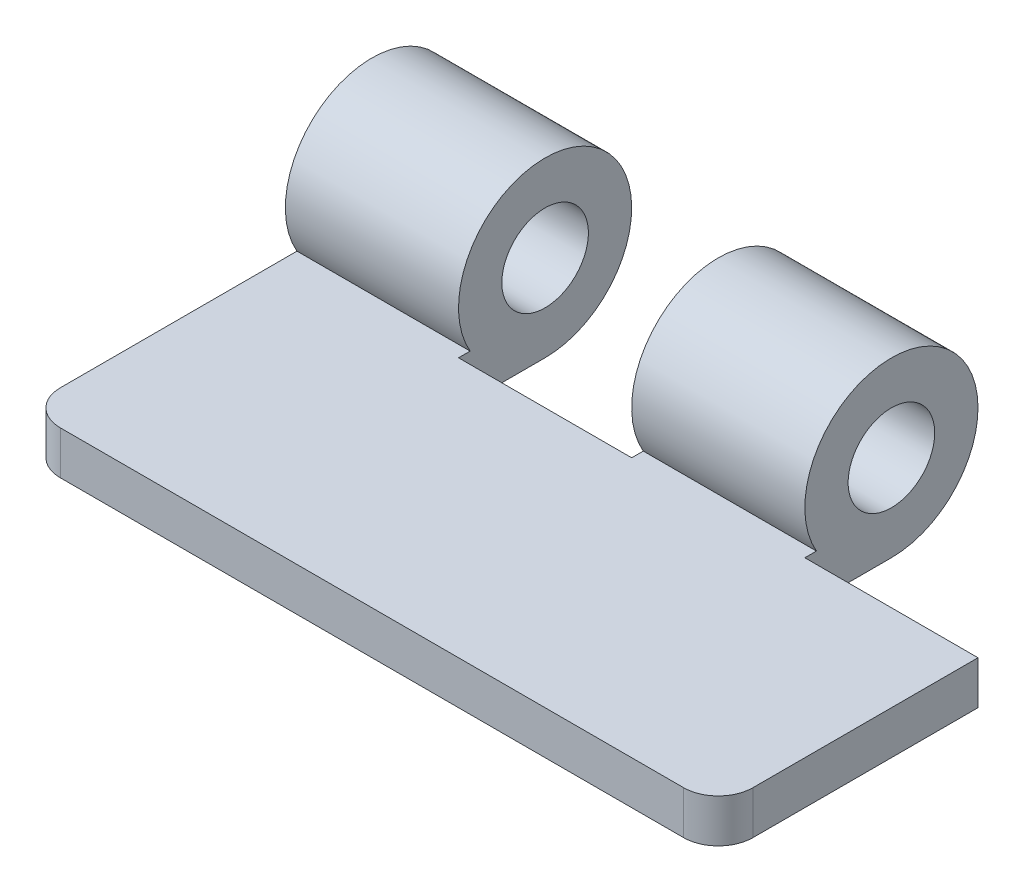
ISO-10303-21;
HEADER;
FILE_DESCRIPTION(('STEP AP214'),'2;1');
FILE_NAME('part.step','',(''),(''),'','','');
FILE_SCHEMA(('AUTOMOTIVE_DESIGN { 1 0 10303 214 1 1 1 1 }'));
ENDSEC;
DATA;
#1=APPLICATION_CONTEXT('core data for automotive mechanical design processes');
#2=APPLICATION_PROTOCOL_DEFINITION('international standard','automotive_design',2000,#1);
#3=PRODUCT_CONTEXT('',#1,'mechanical');
#4=PRODUCT('Part','Part','',(#3));
#5=PRODUCT_RELATED_PRODUCT_CATEGORY('part','',(#4));
#6=PRODUCT_DEFINITION_FORMATION('','',#4);
#7=PRODUCT_DEFINITION_CONTEXT('part definition',#1,'design');
#8=PRODUCT_DEFINITION('design','',#6,#7);
#9=PRODUCT_DEFINITION_SHAPE('','',#8);
#10=(LENGTH_UNIT() NAMED_UNIT(*) SI_UNIT(.MILLI.,.METRE.));
#11=(NAMED_UNIT(*) PLANE_ANGLE_UNIT() SI_UNIT($,.RADIAN.));
#12=(NAMED_UNIT(*) SI_UNIT($,.STERADIAN.) SOLID_ANGLE_UNIT());
#13=UNCERTAINTY_MEASURE_WITH_UNIT(LENGTH_MEASURE(1.E-05),#10,'distance_accuracy_value','');
#14=(GEOMETRIC_REPRESENTATION_CONTEXT(3) GLOBAL_UNCERTAINTY_ASSIGNED_CONTEXT((#13)) GLOBAL_UNIT_ASSIGNED_CONTEXT((#10,
#11,#12)) REPRESENTATION_CONTEXT('',''));
#15=CARTESIAN_POINT('',(0.,0.,0.));
#16=DIRECTION('',(0.,0.,1.));
#17=DIRECTION('',(1.,0.,0.));
#18=AXIS2_PLACEMENT_3D('',#15,#16,#17);
#19=CARTESIAN_POINT('',(0.,3.175,0.));
#20=DIRECTION('',(0.,-1.,0.));
#21=DIRECTION('',(0.,0.,-1.));
#22=AXIS2_PLACEMENT_3D('',#19,#20,#21);
#23=PLANE('',#22);
#24=DIRECTION('',(-1.,0.,0.));
#25=VECTOR('',#24,1.);
#26=CARTESIAN_POINT('',(0.,3.175,-9.95321765143749));
#27=LINE('',#26,#25);
#28=CARTESIAN_POINT('',(0.,3.175,-9.95321765143749));
#29=VERTEX_POINT('',#28);
#30=CARTESIAN_POINT('',(-12.7,3.175,-9.95321765143749));
#31=VERTEX_POINT('',#30);
#32=EDGE_CURVE('E184',#29,#31,#27,.T.);
#33=ORIENTED_EDGE('',*,*,#32,.T.);
#34=DIRECTION('',(0.,0.,-1.));
#35=VECTOR('',#34,1.);
#36=CARTESIAN_POINT('',(-12.7,3.175,-16.3032176514375));
#37=LINE('',#36,#35);
#38=CARTESIAN_POINT('',(-12.7,3.175,-10.8039563374063));
#39=VERTEX_POINT('',#38);
#40=EDGE_CURVE('E57',#31,#39,#37,.T.);
#41=ORIENTED_EDGE('',*,*,#40,.T.);
#42=DIRECTION('',(-1.,0.,0.));
#43=VECTOR('',#42,1.);
#44=CARTESIAN_POINT('',(-12.7,3.175,-10.8039563374063));
#45=LINE('',#44,#43);
#46=CARTESIAN_POINT('',(-25.4,3.175,-10.8039563374063));
#47=VERTEX_POINT('',#46);
#48=EDGE_CURVE('E52',#39,#47,#45,.T.);
#49=ORIENTED_EDGE('',*,*,#48,.T.);
#50=DIRECTION('',(0.,0.,1.));
#51=VECTOR('',#50,1.);
#52=CARTESIAN_POINT('',(-25.4,3.175,-9.09678234856252));
#53=LINE('',#52,#51);
#54=CARTESIAN_POINT('',(-25.4,3.175,6.55678234856252));
#55=VERTEX_POINT('',#54);
#56=EDGE_CURVE('E144',#47,#55,#53,.T.);
#57=ORIENTED_EDGE('',*,*,#56,.T.);
#58=CARTESIAN_POINT('',(-22.86,3.175,6.55678234856252));
#59=DIRECTION('',(0.,-1.,0.));
#60=DIRECTION('',(0.,0.,-1.));
#61=AXIS2_PLACEMENT_3D('',#58,#59,#60);
#62=CIRCLE('',#61,2.54);
#63=CARTESIAN_POINT('',(-22.86,3.175,9.09678234856252));
#64=VERTEX_POINT('',#63);
#65=EDGE_CURVE('E226',#55,#64,#62,.F.);
#66=ORIENTED_EDGE('',*,*,#65,.T.);
#67=DIRECTION('',(1.,0.,0.));
#68=VECTOR('',#67,1.);
#69=CARTESIAN_POINT('',(25.4,3.175,9.09678234856252));
#70=LINE('',#69,#68);
#71=CARTESIAN_POINT('',(22.86,3.175,9.09678234856252));
#72=VERTEX_POINT('',#71);
#73=EDGE_CURVE('E173',#64,#72,#70,.T.);
#74=ORIENTED_EDGE('',*,*,#73,.T.);
#75=CARTESIAN_POINT('',(22.86,3.175,6.55678234856252));
#76=DIRECTION('',(0.,-1.,0.));
#77=DIRECTION('',(0.,0.,-1.));
#78=AXIS2_PLACEMENT_3D('',#75,#76,#77);
#79=CIRCLE('',#78,2.54);
#80=CARTESIAN_POINT('',(25.4,3.175,6.55678234856252));
#81=VERTEX_POINT('',#80);
#82=EDGE_CURVE('E45',#72,#81,#79,.F.);
#83=ORIENTED_EDGE('',*,*,#82,.T.);
#84=DIRECTION('',(0.,0.,-1.));
#85=VECTOR('',#84,1.);
#86=CARTESIAN_POINT('',(25.4,3.175,9.09678234856252));
#87=LINE('',#86,#85);
#88=CARTESIAN_POINT('',(25.4,3.175,-9.95321765143749));
#89=VERTEX_POINT('',#88);
#90=EDGE_CURVE('E176',#81,#89,#87,.T.);
#91=ORIENTED_EDGE('',*,*,#90,.T.);
#92=DIRECTION('',(-1.,0.,0.));
#93=VECTOR('',#92,1.);
#94=CARTESIAN_POINT('',(25.4,3.175,-9.95321765143749));
#95=LINE('',#94,#93);
#96=CARTESIAN_POINT('',(12.7,3.175,-9.95321765143749));
#97=VERTEX_POINT('',#96);
#98=EDGE_CURVE('E178',#89,#97,#95,.T.);
#99=ORIENTED_EDGE('',*,*,#98,.T.);
#100=DIRECTION('',(0.,0.,-1.));
#101=VECTOR('',#100,1.);
#102=CARTESIAN_POINT('',(12.7,3.175,-16.3032176514375));
#103=LINE('',#102,#101);
#104=CARTESIAN_POINT('',(12.7,3.175,-10.8039563374063));
#105=VERTEX_POINT('',#104);
#106=EDGE_CURVE('E180',#97,#105,#103,.T.);
#107=ORIENTED_EDGE('',*,*,#106,.T.);
#108=DIRECTION('',(-1.,0.,0.));
#109=VECTOR('',#108,1.);
#110=CARTESIAN_POINT('',(12.7,3.175,-10.8039563374063));
#111=LINE('',#110,#109);
#112=CARTESIAN_POINT('',(0.,3.175,-10.8039563374063));
#113=VERTEX_POINT('',#112);
#114=EDGE_CURVE('E136',#113,#105,#111,.F.);
#115=ORIENTED_EDGE('',*,*,#114,.F.);
#116=DIRECTION('',(0.,0.,1.));
#117=VECTOR('',#116,1.);
#118=CARTESIAN_POINT('',(0.,3.175,-9.95321765143749));
#119=LINE('',#118,#117);
#120=EDGE_CURVE('E182',#113,#29,#119,.T.);
#121=ORIENTED_EDGE('',*,*,#120,.T.);
#122=EDGE_LOOP('',(#33,#41,#49,#57,#66,#74,#83,#91,#99,#107,#115,#121));
#123=FACE_BOUND('',#122,.T.);
#124=ADVANCED_FACE('F37',(#123),#23,.F.);
#125=CARTESIAN_POINT('',(-25.4,3.175,9.09678234856252));
#126=DIRECTION('',(1.,0.,0.));
#127=DIRECTION('',(0.,0.,-1.));
#128=AXIS2_PLACEMENT_3D('',#125,#126,#127);
#129=PLANE('',#128);
#130=ORIENTED_EDGE('',*,*,#56,.F.);
#131=CARTESIAN_POINT('',(-25.4,6.35,-16.3032176514375));
#132=DIRECTION('',(-1.,0.,0.));
#133=DIRECTION('',(0.,0.,1.));
#134=AXIS2_PLACEMENT_3D('',#131,#132,#133);
#135=CIRCLE('',#134,6.35);
#136=CARTESIAN_POINT('',(-25.4,0.,-16.3032176514375));
#137=VERTEX_POINT('',#136);
#138=EDGE_CURVE('E141',#47,#137,#135,.T.);
#139=ORIENTED_EDGE('',*,*,#138,.T.);
#140=DIRECTION('',(0.,0.,1.));
#141=VECTOR('',#140,1.);
#142=CARTESIAN_POINT('',(-25.4,0.,9.09678234856252));
#143=LINE('',#142,#141);
#144=CARTESIAN_POINT('',(-25.4,0.,6.55678234856252));
#145=VERTEX_POINT('',#144);
#146=EDGE_CURVE('E124',#137,#145,#143,.T.);
#147=ORIENTED_EDGE('',*,*,#146,.T.);
#148=DIRECTION('',(0.,-1.,0.));
#149=VECTOR('',#148,1.);
#150=CARTESIAN_POINT('',(-25.4,3.175,6.55678234856252));
#151=LINE('',#150,#149);
#152=EDGE_CURVE('E11',#145,#55,#151,.F.);
#153=ORIENTED_EDGE('',*,*,#152,.T.);
#154=EDGE_LOOP('',(#130,#139,#147,#153));
#155=FACE_BOUND('',#154,.T.);
#156=CARTESIAN_POINT('',(-25.4,6.35,-16.3032176514375));
#157=DIRECTION('',(-1.,0.,0.));
#158=DIRECTION('',(0.,0.,1.));
#159=AXIS2_PLACEMENT_3D('',#156,#157,#158);
#160=CIRCLE('',#159,3.175);
#161=CARTESIAN_POINT('',(-25.4,6.35,-13.1282176514375));
#162=VERTEX_POINT('',#161);
#163=EDGE_CURVE('E153',#162,#162,#160,.T.);
#164=ORIENTED_EDGE('',*,*,#163,.F.);
#165=EDGE_LOOP('',(#164));
#166=FACE_BOUND('',#165,.T.);
#167=ADVANCED_FACE('F147',(#155,#166),#129,.F.);
#168=CARTESIAN_POINT('',(25.4,3.175,9.09678234856252));
#169=DIRECTION('',(0.,0.,-1.));
#170=DIRECTION('',(-1.,0.,0.));
#171=AXIS2_PLACEMENT_3D('',#168,#169,#170);
#172=PLANE('',#171);
#173=DIRECTION('',(1.,0.,0.));
#174=VECTOR('',#173,1.);
#175=CARTESIAN_POINT('',(25.4,0.,9.09678234856252));
#176=LINE('',#175,#174);
#177=CARTESIAN_POINT('',(-22.86,0.,9.09678234856252));
#178=VERTEX_POINT('',#177);
#179=CARTESIAN_POINT('',(22.86,0.,9.09678234856252));
#180=VERTEX_POINT('',#179);
#181=EDGE_CURVE('E135',#178,#180,#176,.T.);
#182=ORIENTED_EDGE('',*,*,#181,.T.);
#183=DIRECTION('',(0.,-1.,0.));
#184=VECTOR('',#183,1.);
#185=CARTESIAN_POINT('',(22.86,3.175,9.09678234856252));
#186=LINE('',#185,#184);
#187=EDGE_CURVE('E224',#180,#72,#186,.F.);
#188=ORIENTED_EDGE('',*,*,#187,.T.);
#189=ORIENTED_EDGE('',*,*,#73,.F.);
#190=DIRECTION('',(0.,-1.,0.));
#191=VECTOR('',#190,1.);
#192=CARTESIAN_POINT('',(-22.86,3.175,9.09678234856252));
#193=LINE('',#192,#191);
#194=EDGE_CURVE('E221',#64,#178,#193,.T.);
#195=ORIENTED_EDGE('',*,*,#194,.T.);
#196=EDGE_LOOP('',(#182,#188,#189,#195));
#197=FACE_BOUND('',#196,.T.);
#198=ADVANCED_FACE('F241',(#197),#172,.F.);
#199=CARTESIAN_POINT('',(25.4,3.175,9.09678234856252));
#200=DIRECTION('',(-1.,0.,0.));
#201=DIRECTION('',(0.,0.,1.));
#202=AXIS2_PLACEMENT_3D('',#199,#200,#201);
#203=PLANE('',#202);
#204=ORIENTED_EDGE('',*,*,#90,.F.);
#205=DIRECTION('',(0.,-1.,0.));
#206=VECTOR('',#205,1.);
#207=CARTESIAN_POINT('',(25.4,3.175,6.55678234856252));
#208=LINE('',#207,#206);
#209=CARTESIAN_POINT('',(25.4,0.,6.55678234856252));
#210=VERTEX_POINT('',#209);
#211=EDGE_CURVE('E215',#81,#210,#208,.T.);
#212=ORIENTED_EDGE('',*,*,#211,.T.);
#213=DIRECTION('',(0.,0.,-1.));
#214=VECTOR('',#213,1.);
#215=CARTESIAN_POINT('',(25.4,0.,9.09678234856252));
#216=LINE('',#215,#214);
#217=CARTESIAN_POINT('',(25.4,0.,-9.95321765143749));
#218=VERTEX_POINT('',#217);
#219=EDGE_CURVE('E190',#210,#218,#216,.T.);
#220=ORIENTED_EDGE('',*,*,#219,.T.);
#221=DIRECTION('',(0.,-1.,0.));
#222=VECTOR('',#221,1.);
#223=CARTESIAN_POINT('',(25.4,3.175,-9.95321765143749));
#224=LINE('',#223,#222);
#225=EDGE_CURVE('E212',#89,#218,#224,.T.);
#226=ORIENTED_EDGE('',*,*,#225,.F.);
#227=EDGE_LOOP('',(#204,#212,#220,#226));
#228=FACE_BOUND('',#227,.T.);
#229=ADVANCED_FACE('F235',(#228),#203,.F.);
#230=CARTESIAN_POINT('',(25.4,3.175,-9.95321765143749));
#231=DIRECTION('',(0.,0.,1.));
#232=DIRECTION('',(1.,0.,0.));
#233=AXIS2_PLACEMENT_3D('',#230,#231,#232);
#234=PLANE('',#233);
#235=DIRECTION('',(-1.,0.,0.));
#236=VECTOR('',#235,1.);
#237=CARTESIAN_POINT('',(25.4,0.,-9.95321765143749));
#238=LINE('',#237,#236);
#239=CARTESIAN_POINT('',(12.7,0.,-9.95321765143749));
#240=VERTEX_POINT('',#239);
#241=EDGE_CURVE('E192',#218,#240,#238,.T.);
#242=ORIENTED_EDGE('',*,*,#241,.T.);
#243=DIRECTION('',(0.,-1.,0.));
#244=VECTOR('',#243,1.);
#245=CARTESIAN_POINT('',(12.7,3.175,-9.95321765143749));
#246=LINE('',#245,#244);
#247=EDGE_CURVE('E209',#97,#240,#246,.T.);
#248=ORIENTED_EDGE('',*,*,#247,.F.);
#249=ORIENTED_EDGE('',*,*,#98,.F.);
#250=ORIENTED_EDGE('',*,*,#225,.T.);
#251=EDGE_LOOP('',(#242,#248,#249,#250));
#252=FACE_BOUND('',#251,.T.);
#253=ADVANCED_FACE('F280',(#252),#234,.F.);
#254=CARTESIAN_POINT('',(12.7,3.175,-16.3032176514375));
#255=DIRECTION('',(-1.,0.,0.));
#256=DIRECTION('',(0.,0.,1.));
#257=AXIS2_PLACEMENT_3D('',#254,#255,#256);
#258=PLANE('',#257);
#259=DIRECTION('',(0.,0.,-1.));
#260=VECTOR('',#259,1.);
#261=CARTESIAN_POINT('',(12.7,0.,-16.3032176514375));
#262=LINE('',#261,#260);
#263=CARTESIAN_POINT('',(12.7,0.,-16.3032176514375));
#264=VERTEX_POINT('',#263);
#265=EDGE_CURVE('E194',#240,#264,#262,.T.);
#266=ORIENTED_EDGE('',*,*,#265,.T.);
#267=CARTESIAN_POINT('',(12.7,6.35,-16.3032176514375));
#268=DIRECTION('',(1.,0.,0.));
#269=DIRECTION('',(0.,0.,-1.));
#270=AXIS2_PLACEMENT_3D('',#267,#268,#269);
#271=CIRCLE('',#270,6.35);
#272=EDGE_CURVE('E165',#264,#105,#271,.T.);
#273=ORIENTED_EDGE('',*,*,#272,.T.);
#274=ORIENTED_EDGE('',*,*,#106,.F.);
#275=ORIENTED_EDGE('',*,*,#247,.T.);
#276=EDGE_LOOP('',(#266,#273,#274,#275));
#277=FACE_BOUND('',#276,.T.);
#278=CARTESIAN_POINT('',(12.7,6.35,-16.3032176514375));
#279=DIRECTION('',(1.,0.,0.));
#280=DIRECTION('',(0.,0.,-1.));
#281=AXIS2_PLACEMENT_3D('',#278,#279,#280);
#282=CIRCLE('',#281,3.175);
#283=CARTESIAN_POINT('',(12.7,6.35,-19.4782176514375));
#284=VERTEX_POINT('',#283);
#285=EDGE_CURVE('E159',#284,#284,#282,.T.);
#286=ORIENTED_EDGE('',*,*,#285,.F.);
#287=EDGE_LOOP('',(#286));
#288=FACE_BOUND('',#287,.T.);
#289=ADVANCED_FACE('F276',(#277,#288),#258,.F.);
#290=CARTESIAN_POINT('',(0.,3.175,-9.95321765143749));
#291=DIRECTION('',(1.,0.,0.));
#292=DIRECTION('',(0.,0.,-1.));
#293=AXIS2_PLACEMENT_3D('',#290,#291,#292);
#294=PLANE('',#293);
#295=CARTESIAN_POINT('',(0.,6.35,-16.3032176514375));
#296=DIRECTION('',(1.,0.,0.));
#297=DIRECTION('',(0.,0.,-1.));
#298=AXIS2_PLACEMENT_3D('',#295,#296,#297);
#299=CIRCLE('',#298,6.35);
#300=CARTESIAN_POINT('',(0.,0.,-16.3032176514375));
#301=VERTEX_POINT('',#300);
#302=EDGE_CURVE('E162',#301,#113,#299,.T.);
#303=ORIENTED_EDGE('',*,*,#302,.F.);
#304=DIRECTION('',(0.,0.,1.));
#305=VECTOR('',#304,1.);
#306=CARTESIAN_POINT('',(0.,0.,-9.95321765143749));
#307=LINE('',#306,#305);
#308=CARTESIAN_POINT('',(0.,0.,-9.95321765143749));
#309=VERTEX_POINT('',#308);
#310=EDGE_CURVE('E199',#301,#309,#307,.T.);
#311=ORIENTED_EDGE('',*,*,#310,.T.);
#312=DIRECTION('',(0.,-1.,0.));
#313=VECTOR('',#312,1.);
#314=CARTESIAN_POINT('',(0.,3.175,-9.95321765143749));
#315=LINE('',#314,#313);
#316=EDGE_CURVE('E206',#29,#309,#315,.T.);
#317=ORIENTED_EDGE('',*,*,#316,.F.);
#318=ORIENTED_EDGE('',*,*,#120,.F.);
#319=EDGE_LOOP('',(#303,#311,#317,#318));
#320=FACE_BOUND('',#319,.T.);
#321=CARTESIAN_POINT('',(0.,6.35,-16.3032176514375));
#322=DIRECTION('',(1.,0.,0.));
#323=DIRECTION('',(0.,0.,-1.));
#324=AXIS2_PLACEMENT_3D('',#321,#322,#323);
#325=CIRCLE('',#324,3.175);
#326=CARTESIAN_POINT('',(0.,6.35,-19.4782176514375));
#327=VERTEX_POINT('',#326);
#328=EDGE_CURVE('E158',#327,#327,#325,.T.);
#329=ORIENTED_EDGE('',*,*,#328,.T.);
#330=EDGE_LOOP('',(#329));
#331=FACE_BOUND('',#330,.T.);
#332=ADVANCED_FACE('F272',(#320,#331),#294,.F.);
#333=CARTESIAN_POINT('',(0.,3.175,-9.95321765143749));
#334=DIRECTION('',(0.,0.,1.));
#335=DIRECTION('',(1.,0.,0.));
#336=AXIS2_PLACEMENT_3D('',#333,#334,#335);
#337=PLANE('',#336);
#338=DIRECTION('',(-1.,0.,0.));
#339=VECTOR('',#338,1.);
#340=CARTESIAN_POINT('',(0.,0.,-9.95321765143749));
#341=LINE('',#340,#339);
#342=CARTESIAN_POINT('',(-12.7,0.,-9.95321765143749));
#343=VERTEX_POINT('',#342);
#344=EDGE_CURVE('E201',#309,#343,#341,.T.);
#345=ORIENTED_EDGE('',*,*,#344,.T.);
#346=DIRECTION('',(0.,-1.,0.));
#347=VECTOR('',#346,1.);
#348=CARTESIAN_POINT('',(-12.7,3.175,-9.95321765143749));
#349=LINE('',#348,#347);
#350=EDGE_CURVE('E186',#31,#343,#349,.T.);
#351=ORIENTED_EDGE('',*,*,#350,.F.);
#352=ORIENTED_EDGE('',*,*,#32,.F.);
#353=ORIENTED_EDGE('',*,*,#316,.T.);
#354=EDGE_LOOP('',(#345,#351,#352,#353));
#355=FACE_BOUND('',#354,.T.);
#356=ADVANCED_FACE('F268',(#355),#337,.F.);
#357=CARTESIAN_POINT('',(-12.7,3.175,-16.3032176514375));
#358=DIRECTION('',(-1.,0.,0.));
#359=DIRECTION('',(0.,0.,1.));
#360=AXIS2_PLACEMENT_3D('',#357,#358,#359);
#361=PLANE('',#360);
#362=CARTESIAN_POINT('',(-12.7,6.35,-16.3032176514375));
#363=DIRECTION('',(-1.,0.,0.));
#364=DIRECTION('',(0.,0.,1.));
#365=AXIS2_PLACEMENT_3D('',#362,#363,#364);
#366=CIRCLE('',#365,3.175);
#367=CARTESIAN_POINT('',(-12.7,6.35,-13.1282176514375));
#368=VERTEX_POINT('',#367);
#369=EDGE_CURVE('E149',#368,#368,#366,.T.);
#370=ORIENTED_EDGE('',*,*,#369,.T.);
#371=EDGE_LOOP('',(#370));
#372=FACE_BOUND('',#371,.T.);
#373=DIRECTION('',(0.,0.,-1.));
#374=VECTOR('',#373,1.);
#375=CARTESIAN_POINT('',(-12.7,0.,-16.3032176514375));
#376=LINE('',#375,#374);
#377=CARTESIAN_POINT('',(-12.7,0.,-16.3032176514375));
#378=VERTEX_POINT('',#377);
#379=EDGE_CURVE('E145',#343,#378,#376,.T.);
#380=ORIENTED_EDGE('',*,*,#379,.T.);
#381=CARTESIAN_POINT('',(-12.7,6.35,-16.3032176514375));
#382=DIRECTION('',(-1.,0.,0.));
#383=DIRECTION('',(0.,0.,1.));
#384=AXIS2_PLACEMENT_3D('',#381,#382,#383);
#385=CIRCLE('',#384,6.35);
#386=EDGE_CURVE('E143',#39,#378,#385,.T.);
#387=ORIENTED_EDGE('',*,*,#386,.F.);
#388=ORIENTED_EDGE('',*,*,#40,.F.);
#389=ORIENTED_EDGE('',*,*,#350,.T.);
#390=EDGE_LOOP('',(#380,#387,#388,#389));
#391=FACE_BOUND('',#390,.T.);
#392=ADVANCED_FACE('F265',(#372,#391),#361,.F.);
#393=CARTESIAN_POINT('',(0.,0.,0.));
#394=DIRECTION('',(0.,-1.,0.));
#395=DIRECTION('',(0.,0.,-1.));
#396=AXIS2_PLACEMENT_3D('',#393,#394,#395);
#397=PLANE('',#396);
#398=CARTESIAN_POINT('',(-22.86,0.,6.55678234856252));
#399=DIRECTION('',(0.,-1.,0.));
#400=DIRECTION('',(0.,0.,-1.));
#401=AXIS2_PLACEMENT_3D('',#398,#399,#400);
#402=CIRCLE('',#401,2.54);
#403=EDGE_CURVE('E131',#178,#145,#402,.T.);
#404=ORIENTED_EDGE('',*,*,#403,.T.);
#405=ORIENTED_EDGE('',*,*,#146,.F.);
#406=DIRECTION('',(-1.,0.,0.));
#407=VECTOR('',#406,1.);
#408=CARTESIAN_POINT('',(-25.4,0.,-16.3032176514375));
#409=LINE('',#408,#407);
#410=EDGE_CURVE('E128',#378,#137,#409,.T.);
#411=ORIENTED_EDGE('',*,*,#410,.F.);
#412=ORIENTED_EDGE('',*,*,#379,.F.);
#413=ORIENTED_EDGE('',*,*,#344,.F.);
#414=ORIENTED_EDGE('',*,*,#310,.F.);
#415=DIRECTION('',(-1.,0.,0.));
#416=VECTOR('',#415,1.);
#417=CARTESIAN_POINT('',(0.,0.,-16.3032176514375));
#418=LINE('',#417,#416);
#419=EDGE_CURVE('E196',#264,#301,#418,.T.);
#420=ORIENTED_EDGE('',*,*,#419,.F.);
#421=ORIENTED_EDGE('',*,*,#265,.F.);
#422=ORIENTED_EDGE('',*,*,#241,.F.);
#423=ORIENTED_EDGE('',*,*,#219,.F.);
#424=CARTESIAN_POINT('',(22.86,0.,6.55678234856252));
#425=DIRECTION('',(0.,-1.,0.));
#426=DIRECTION('',(0.,0.,-1.));
#427=AXIS2_PLACEMENT_3D('',#424,#425,#426);
#428=CIRCLE('',#427,2.54);
#429=EDGE_CURVE('E219',#210,#180,#428,.T.);
#430=ORIENTED_EDGE('',*,*,#429,.T.);
#431=ORIENTED_EDGE('',*,*,#181,.F.);
#432=EDGE_LOOP('',(#404,#405,#411,#412,#413,#414,#420,#421,#422,#423,#430,#431));
#433=FACE_BOUND('',#432,.T.);
#434=ADVANCED_FACE('F126',(#433),#397,.T.);
#435=CARTESIAN_POINT('',(12.7,6.35,-16.3032176514375));
#436=DIRECTION('',(-1.,0.,0.));
#437=DIRECTION('',(0.,0.,1.));
#438=AXIS2_PLACEMENT_3D('',#435,#436,#437);
#439=CYLINDRICAL_SURFACE('',#438,6.35);
#440=ORIENTED_EDGE('',*,*,#302,.T.);
#441=ORIENTED_EDGE('',*,*,#114,.T.);
#442=ORIENTED_EDGE('',*,*,#272,.F.);
#443=ORIENTED_EDGE('',*,*,#419,.T.);
#444=EDGE_LOOP('',(#440,#441,#442,#443));
#445=FACE_BOUND('',#444,.T.);
#446=ADVANCED_FACE('F261',(#445),#439,.T.);
#447=CARTESIAN_POINT('',(12.7,6.35,-16.3032176514375));
#448=DIRECTION('',(-1.,0.,0.));
#449=DIRECTION('',(0.,0.,1.));
#450=AXIS2_PLACEMENT_3D('',#447,#448,#449);
#451=CYLINDRICAL_SURFACE('',#450,3.175);
#452=ORIENTED_EDGE('',*,*,#285,.T.);
#453=EDGE_LOOP('',(#452));
#454=FACE_BOUND('',#453,.T.);
#455=ORIENTED_EDGE('',*,*,#328,.F.);
#456=EDGE_LOOP('',(#455));
#457=FACE_BOUND('',#456,.T.);
#458=ADVANCED_FACE('F252',(#454,#457),#451,.F.);
#459=CARTESIAN_POINT('',(22.86,3.175,6.55678234856252));
#460=DIRECTION('',(0.,-1.,0.));
#461=DIRECTION('',(0.,0.,-1.));
#462=AXIS2_PLACEMENT_3D('',#459,#460,#461);
#463=CYLINDRICAL_SURFACE('',#462,2.54);
#464=ORIENTED_EDGE('',*,*,#82,.F.);
#465=ORIENTED_EDGE('',*,*,#187,.F.);
#466=ORIENTED_EDGE('',*,*,#429,.F.);
#467=ORIENTED_EDGE('',*,*,#211,.F.);
#468=EDGE_LOOP('',(#464,#465,#466,#467));
#469=FACE_BOUND('',#468,.T.);
#470=ADVANCED_FACE('F238',(#469),#463,.T.);
#471=CARTESIAN_POINT('',(-22.86,3.175,6.55678234856252));
#472=DIRECTION('',(0.,-1.,0.));
#473=DIRECTION('',(0.,0.,-1.));
#474=AXIS2_PLACEMENT_3D('',#471,#472,#473);
#475=CYLINDRICAL_SURFACE('',#474,2.54);
#476=ORIENTED_EDGE('',*,*,#65,.F.);
#477=ORIENTED_EDGE('',*,*,#152,.F.);
#478=ORIENTED_EDGE('',*,*,#403,.F.);
#479=ORIENTED_EDGE('',*,*,#194,.F.);
#480=EDGE_LOOP('',(#476,#477,#478,#479));
#481=FACE_BOUND('',#480,.T.);
#482=ADVANCED_FACE('F39',(#481),#475,.T.);
#483=CARTESIAN_POINT('',(-12.7,6.35,-16.3032176514375));
#484=DIRECTION('',(-1.,0.,0.));
#485=DIRECTION('',(0.,0.,1.));
#486=AXIS2_PLACEMENT_3D('',#483,#484,#485);
#487=CYLINDRICAL_SURFACE('',#486,6.35);
#488=ORIENTED_EDGE('',*,*,#138,.F.);
#489=ORIENTED_EDGE('',*,*,#48,.F.);
#490=ORIENTED_EDGE('',*,*,#386,.T.);
#491=ORIENTED_EDGE('',*,*,#410,.T.);
#492=EDGE_LOOP('',(#488,#489,#490,#491));
#493=FACE_BOUND('',#492,.T.);
#494=ADVANCED_FACE('F140',(#493),#487,.T.);
#495=CARTESIAN_POINT('',(-12.7,6.35,-16.3032176514375));
#496=DIRECTION('',(-1.,0.,0.));
#497=DIRECTION('',(0.,0.,1.));
#498=AXIS2_PLACEMENT_3D('',#495,#496,#497);
#499=CYLINDRICAL_SURFACE('',#498,3.175);
#500=ORIENTED_EDGE('',*,*,#369,.F.);
#501=EDGE_LOOP('',(#500));
#502=FACE_BOUND('',#501,.T.);
#503=ORIENTED_EDGE('',*,*,#163,.T.);
#504=EDGE_LOOP('',(#503));
#505=FACE_BOUND('',#504,.T.);
#506=ADVANCED_FACE('F250',(#502,#505),#499,.F.);
#507=CLOSED_SHELL('',(#124,#167,#198,#229,#253,#289,#332,#356,#392,#434,#446,#458,#470,#482,
#494,#506));
#508=MANIFOLD_SOLID_BREP('B2',#507);
#509=ADVANCED_BREP_SHAPE_REPRESENTATION('',(#18,#508),#14);
#510=SHAPE_DEFINITION_REPRESENTATION(#9,#509);
ENDSEC;
END-ISO-10303-21;
